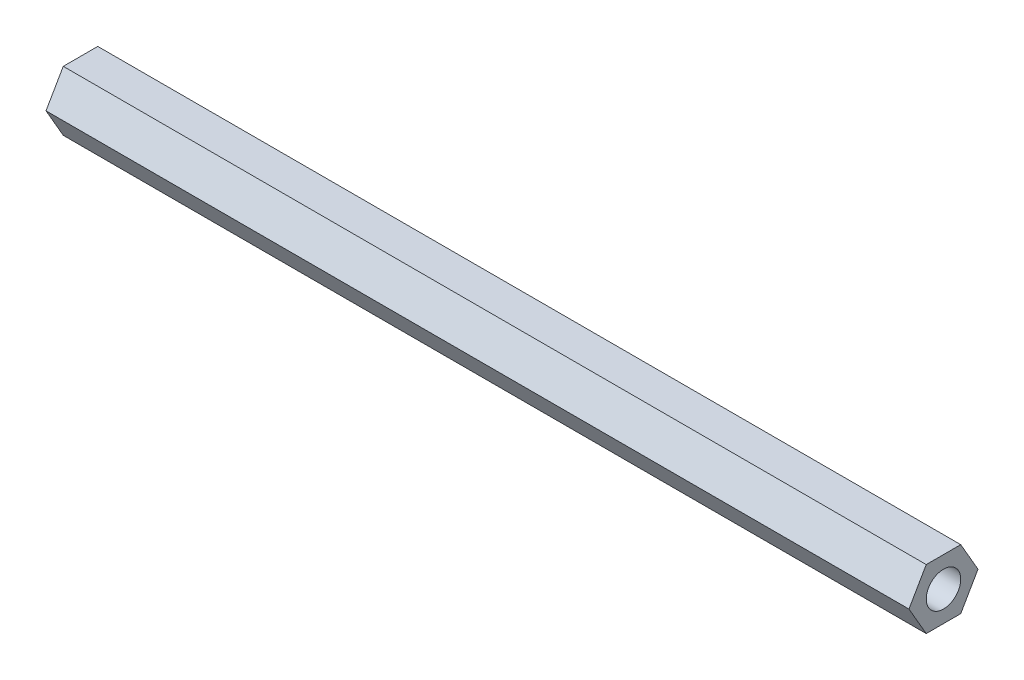
ISO-10303-21;
HEADER;
FILE_DESCRIPTION(('STEP AP214'),'2;1');
FILE_NAME('part.step','',(''),(''),'','','');
FILE_SCHEMA(('AUTOMOTIVE_DESIGN { 1 0 10303 214 1 1 1 1 }'));
ENDSEC;
DATA;
#1=APPLICATION_CONTEXT('core data for automotive mechanical design processes');
#2=APPLICATION_PROTOCOL_DEFINITION('international standard','automotive_design',2000,#1);
#3=PRODUCT_CONTEXT('',#1,'mechanical');
#4=PRODUCT('Part','Part','',(#3));
#5=PRODUCT_RELATED_PRODUCT_CATEGORY('part','',(#4));
#6=PRODUCT_DEFINITION_FORMATION('','',#4);
#7=PRODUCT_DEFINITION_CONTEXT('part definition',#1,'design');
#8=PRODUCT_DEFINITION('design','',#6,#7);
#9=PRODUCT_DEFINITION_SHAPE('','',#8);
#10=(LENGTH_UNIT() NAMED_UNIT(*) SI_UNIT(.MILLI.,.METRE.));
#11=(NAMED_UNIT(*) PLANE_ANGLE_UNIT() SI_UNIT($,.RADIAN.));
#12=(NAMED_UNIT(*) SI_UNIT($,.STERADIAN.) SOLID_ANGLE_UNIT());
#13=UNCERTAINTY_MEASURE_WITH_UNIT(LENGTH_MEASURE(1.E-05),#10,'distance_accuracy_value','');
#14=(GEOMETRIC_REPRESENTATION_CONTEXT(3) GLOBAL_UNCERTAINTY_ASSIGNED_CONTEXT((#13)) GLOBAL_UNIT_ASSIGNED_CONTEXT((#10,
#11,#12)) REPRESENTATION_CONTEXT('',''));
#15=CARTESIAN_POINT('',(0.,0.,0.));
#16=DIRECTION('',(0.,0.,1.));
#17=DIRECTION('',(1.,0.,0.));
#18=AXIS2_PLACEMENT_3D('',#15,#16,#17);
#19=CARTESIAN_POINT('',(50.,0.,0.));
#20=DIRECTION('',(1.,0.,0.));
#21=DIRECTION('',(0.,0.,-1.));
#22=AXIS2_PLACEMENT_3D('',#19,#20,#21);
#23=PLANE('',#22);
#24=DIRECTION('',(0.,0.866025403784438,0.5));
#25=VECTOR('',#24,1.);
#26=CARTESIAN_POINT('',(50.,0.,-2.));
#27=LINE('',#26,#25);
#28=CARTESIAN_POINT('',(50.,0.,-2.));
#29=VERTEX_POINT('',#28);
#30=CARTESIAN_POINT('',(50.,1.73205080756888,-0.999999999999999));
#31=VERTEX_POINT('',#30);
#32=EDGE_CURVE('E152',#29,#31,#27,.T.);
#33=ORIENTED_EDGE('',*,*,#32,.T.);
#34=DIRECTION('',(0.,0.,1.));
#35=VECTOR('',#34,1.);
#36=CARTESIAN_POINT('',(50.,1.73205080756888,-0.999999999999999));
#37=LINE('',#36,#35);
#38=CARTESIAN_POINT('',(50.,1.73205080756888,1.));
#39=VERTEX_POINT('',#38);
#40=EDGE_CURVE('E100',#31,#39,#37,.T.);
#41=ORIENTED_EDGE('',*,*,#40,.T.);
#42=DIRECTION('',(0.,-0.866025403784439,0.5));
#43=VECTOR('',#42,1.);
#44=CARTESIAN_POINT('',(50.,1.73205080756888,1.));
#45=LINE('',#44,#43);
#46=CARTESIAN_POINT('',(50.,0.,2.));
#47=VERTEX_POINT('',#46);
#48=EDGE_CURVE('E113',#39,#47,#45,.T.);
#49=ORIENTED_EDGE('',*,*,#48,.T.);
#50=DIRECTION('',(0.,-0.866025403784439,-0.5));
#51=VECTOR('',#50,1.);
#52=CARTESIAN_POINT('',(50.,0.,2.));
#53=LINE('',#52,#51);
#54=CARTESIAN_POINT('',(50.,-1.73205080756888,0.999999999999999));
#55=VERTEX_POINT('',#54);
#56=EDGE_CURVE('E107',#47,#55,#53,.T.);
#57=ORIENTED_EDGE('',*,*,#56,.T.);
#58=DIRECTION('',(0.,0.,-1.));
#59=VECTOR('',#58,1.);
#60=CARTESIAN_POINT('',(50.,-1.73205080756888,0.999999999999999));
#61=LINE('',#60,#59);
#62=CARTESIAN_POINT('',(50.,-1.73205080756888,-1.));
#63=VERTEX_POINT('',#62);
#64=EDGE_CURVE('E111',#55,#63,#61,.T.);
#65=ORIENTED_EDGE('',*,*,#64,.T.);
#66=DIRECTION('',(0.,0.866025403784439,-0.5));
#67=VECTOR('',#66,1.);
#68=CARTESIAN_POINT('',(50.,-1.73205080756888,-1.));
#69=LINE('',#68,#67);
#70=EDGE_CURVE('E63',#63,#29,#69,.T.);
#71=ORIENTED_EDGE('',*,*,#70,.T.);
#72=EDGE_LOOP('',(#33,#41,#49,#57,#65,#71));
#73=FACE_BOUND('',#72,.T.);
#74=CARTESIAN_POINT('',(50.,0.,0.));
#75=DIRECTION('',(1.,0.,0.));
#76=DIRECTION('',(0.,0.,-1.));
#77=AXIS2_PLACEMENT_3D('',#74,#75,#76);
#78=CIRCLE('',#77,1.);
#79=CARTESIAN_POINT('',(50.,0.,-1.));
#80=VERTEX_POINT('',#79);
#81=EDGE_CURVE('E140',#80,#80,#78,.T.);
#82=ORIENTED_EDGE('',*,*,#81,.F.);
#83=EDGE_LOOP('',(#82));
#84=FACE_BOUND('',#83,.T.);
#85=ADVANCED_FACE('F45',(#73,#84),#23,.T.);
#86=CARTESIAN_POINT('',(0.,0.,0.));
#87=DIRECTION('',(1.,0.,0.));
#88=DIRECTION('',(0.,0.,-1.));
#89=AXIS2_PLACEMENT_3D('',#86,#87,#88);
#90=PLANE('',#89);
#91=DIRECTION('',(0.,0.866025403784438,0.5));
#92=VECTOR('',#91,1.);
#93=CARTESIAN_POINT('',(0.,0.,-2.));
#94=LINE('',#93,#92);
#95=CARTESIAN_POINT('',(0.,0.,-2.));
#96=VERTEX_POINT('',#95);
#97=CARTESIAN_POINT('',(0.,1.73205080756888,-0.999999999999999));
#98=VERTEX_POINT('',#97);
#99=EDGE_CURVE('E135',#96,#98,#94,.T.);
#100=ORIENTED_EDGE('',*,*,#99,.F.);
#101=DIRECTION('',(0.,0.866025403784439,-0.5));
#102=VECTOR('',#101,1.);
#103=CARTESIAN_POINT('',(0.,-1.73205080756888,-1.));
#104=LINE('',#103,#102);
#105=CARTESIAN_POINT('',(0.,-1.73205080756888,-1.));
#106=VERTEX_POINT('',#105);
#107=EDGE_CURVE('E92',#106,#96,#104,.T.);
#108=ORIENTED_EDGE('',*,*,#107,.F.);
#109=DIRECTION('',(0.,0.,-1.));
#110=VECTOR('',#109,1.);
#111=CARTESIAN_POINT('',(0.,-1.73205080756888,0.999999999999999));
#112=LINE('',#111,#110);
#113=CARTESIAN_POINT('',(0.,-1.73205080756888,0.999999999999999));
#114=VERTEX_POINT('',#113);
#115=EDGE_CURVE('E86',#114,#106,#112,.T.);
#116=ORIENTED_EDGE('',*,*,#115,.F.);
#117=DIRECTION('',(0.,-0.866025403784439,-0.5));
#118=VECTOR('',#117,1.);
#119=CARTESIAN_POINT('',(0.,0.,2.));
#120=LINE('',#119,#118);
#121=CARTESIAN_POINT('',(0.,0.,2.));
#122=VERTEX_POINT('',#121);
#123=EDGE_CURVE('E122',#122,#114,#120,.T.);
#124=ORIENTED_EDGE('',*,*,#123,.F.);
#125=DIRECTION('',(0.,-0.866025403784439,0.5));
#126=VECTOR('',#125,1.);
#127=CARTESIAN_POINT('',(0.,1.73205080756888,1.));
#128=LINE('',#127,#126);
#129=CARTESIAN_POINT('',(0.,1.73205080756888,1.));
#130=VERTEX_POINT('',#129);
#131=EDGE_CURVE('E143',#130,#122,#128,.T.);
#132=ORIENTED_EDGE('',*,*,#131,.F.);
#133=DIRECTION('',(0.,0.,1.));
#134=VECTOR('',#133,1.);
#135=CARTESIAN_POINT('',(0.,1.73205080756888,-0.999999999999999));
#136=LINE('',#135,#134);
#137=EDGE_CURVE('E139',#98,#130,#136,.T.);
#138=ORIENTED_EDGE('',*,*,#137,.F.);
#139=EDGE_LOOP('',(#100,#108,#116,#124,#132,#138));
#140=FACE_BOUND('',#139,.T.);
#141=CARTESIAN_POINT('',(0.,0.,0.));
#142=DIRECTION('',(1.,0.,0.));
#143=DIRECTION('',(0.,0.,-1.));
#144=AXIS2_PLACEMENT_3D('',#141,#142,#143);
#145=CIRCLE('',#144,1.);
#146=CARTESIAN_POINT('',(0.,0.,-1.));
#147=VERTEX_POINT('',#146);
#148=EDGE_CURVE('E249',#147,#147,#145,.T.);
#149=ORIENTED_EDGE('',*,*,#148,.T.);
#150=EDGE_LOOP('',(#149));
#151=FACE_BOUND('',#150,.T.);
#152=ADVANCED_FACE('F165',(#140,#151),#90,.F.);
#153=CARTESIAN_POINT('',(50.,0.,-2.));
#154=DIRECTION('',(0.,-0.5,0.866025403784438));
#155=DIRECTION('',(0.,-0.866025403784438,-0.5));
#156=AXIS2_PLACEMENT_3D('',#153,#154,#155);
#157=PLANE('',#156);
#158=ORIENTED_EDGE('',*,*,#99,.T.);
#159=DIRECTION('',(-1.,0.,0.));
#160=VECTOR('',#159,1.);
#161=CARTESIAN_POINT('',(50.,1.73205080756888,-0.999999999999999));
#162=LINE('',#161,#160);
#163=EDGE_CURVE('E11',#31,#98,#162,.T.);
#164=ORIENTED_EDGE('',*,*,#163,.F.);
#165=ORIENTED_EDGE('',*,*,#32,.F.);
#166=DIRECTION('',(-1.,0.,0.));
#167=VECTOR('',#166,1.);
#168=CARTESIAN_POINT('',(50.,0.,-2.));
#169=LINE('',#168,#167);
#170=EDGE_CURVE('E131',#29,#96,#169,.T.);
#171=ORIENTED_EDGE('',*,*,#170,.T.);
#172=EDGE_LOOP('',(#158,#164,#165,#171));
#173=FACE_BOUND('',#172,.T.);
#174=ADVANCED_FACE('F47',(#173),#157,.F.);
#175=CARTESIAN_POINT('',(50.,1.73205080756888,-0.999999999999999));
#176=DIRECTION('',(0.,-1.,0.));
#177=DIRECTION('',(0.,0.,-1.));
#178=AXIS2_PLACEMENT_3D('',#175,#176,#177);
#179=PLANE('',#178);
#180=ORIENTED_EDGE('',*,*,#137,.T.);
#181=DIRECTION('',(-1.,0.,0.));
#182=VECTOR('',#181,1.);
#183=CARTESIAN_POINT('',(50.,1.73205080756888,1.));
#184=LINE('',#183,#182);
#185=EDGE_CURVE('E55',#39,#130,#184,.T.);
#186=ORIENTED_EDGE('',*,*,#185,.F.);
#187=ORIENTED_EDGE('',*,*,#40,.F.);
#188=ORIENTED_EDGE('',*,*,#163,.T.);
#189=EDGE_LOOP('',(#180,#186,#187,#188));
#190=FACE_BOUND('',#189,.T.);
#191=ADVANCED_FACE('F190',(#190),#179,.F.);
#192=CARTESIAN_POINT('',(50.,1.73205080756888,1.));
#193=DIRECTION('',(0.,-0.5,-0.866025403784439));
#194=DIRECTION('',(0.,0.866025403784439,-0.5));
#195=AXIS2_PLACEMENT_3D('',#192,#193,#194);
#196=PLANE('',#195);
#197=ORIENTED_EDGE('',*,*,#131,.T.);
#198=DIRECTION('',(-1.,0.,0.));
#199=VECTOR('',#198,1.);
#200=CARTESIAN_POINT('',(50.,0.,2.));
#201=LINE('',#200,#199);
#202=EDGE_CURVE('E124',#47,#122,#201,.T.);
#203=ORIENTED_EDGE('',*,*,#202,.F.);
#204=ORIENTED_EDGE('',*,*,#48,.F.);
#205=ORIENTED_EDGE('',*,*,#185,.T.);
#206=EDGE_LOOP('',(#197,#203,#204,#205));
#207=FACE_BOUND('',#206,.T.);
#208=ADVANCED_FACE('F162',(#207),#196,.F.);
#209=CARTESIAN_POINT('',(50.,0.,2.));
#210=DIRECTION('',(0.,0.5,-0.866025403784439));
#211=DIRECTION('',(0.,0.866025403784439,0.5));
#212=AXIS2_PLACEMENT_3D('',#209,#210,#211);
#213=PLANE('',#212);
#214=ORIENTED_EDGE('',*,*,#123,.T.);
#215=DIRECTION('',(-1.,0.,0.));
#216=VECTOR('',#215,1.);
#217=CARTESIAN_POINT('',(50.,-1.73205080756888,0.999999999999999));
#218=LINE('',#217,#216);
#219=EDGE_CURVE('E119',#55,#114,#218,.T.);
#220=ORIENTED_EDGE('',*,*,#219,.F.);
#221=ORIENTED_EDGE('',*,*,#56,.F.);
#222=ORIENTED_EDGE('',*,*,#202,.T.);
#223=EDGE_LOOP('',(#214,#220,#221,#222));
#224=FACE_BOUND('',#223,.T.);
#225=ADVANCED_FACE('F120',(#224),#213,.F.);
#226=CARTESIAN_POINT('',(50.,-1.73205080756888,0.999999999999999));
#227=DIRECTION('',(0.,1.,0.));
#228=DIRECTION('',(0.,0.,1.));
#229=AXIS2_PLACEMENT_3D('',#226,#227,#228);
#230=PLANE('',#229);
#231=ORIENTED_EDGE('',*,*,#115,.T.);
#232=DIRECTION('',(-1.,0.,0.));
#233=VECTOR('',#232,1.);
#234=CARTESIAN_POINT('',(50.,-1.73205080756888,-1.));
#235=LINE('',#234,#233);
#236=EDGE_CURVE('E125',#63,#106,#235,.T.);
#237=ORIENTED_EDGE('',*,*,#236,.F.);
#238=ORIENTED_EDGE('',*,*,#64,.F.);
#239=ORIENTED_EDGE('',*,*,#219,.T.);
#240=EDGE_LOOP('',(#231,#237,#238,#239));
#241=FACE_BOUND('',#240,.T.);
#242=ADVANCED_FACE('F127',(#241),#230,.F.);
#243=CARTESIAN_POINT('',(50.,-1.73205080756888,-1.));
#244=DIRECTION('',(0.,0.5,0.866025403784439));
#245=DIRECTION('',(0.,-0.866025403784439,0.5));
#246=AXIS2_PLACEMENT_3D('',#243,#244,#245);
#247=PLANE('',#246);
#248=ORIENTED_EDGE('',*,*,#107,.T.);
#249=ORIENTED_EDGE('',*,*,#170,.F.);
#250=ORIENTED_EDGE('',*,*,#70,.F.);
#251=ORIENTED_EDGE('',*,*,#236,.T.);
#252=EDGE_LOOP('',(#248,#249,#250,#251));
#253=FACE_BOUND('',#252,.T.);
#254=ADVANCED_FACE('F170',(#253),#247,.F.);
#255=CARTESIAN_POINT('',(50.,0.,0.));
#256=DIRECTION('',(-1.,0.,0.));
#257=DIRECTION('',(0.,0.,1.));
#258=AXIS2_PLACEMENT_3D('',#255,#256,#257);
#259=CYLINDRICAL_SURFACE('',#258,1.);
#260=ORIENTED_EDGE('',*,*,#81,.T.);
#261=EDGE_LOOP('',(#260));
#262=FACE_BOUND('',#261,.T.);
#263=ORIENTED_EDGE('',*,*,#148,.F.);
#264=EDGE_LOOP('',(#263));
#265=FACE_BOUND('',#264,.T.);
#266=ADVANCED_FACE('F172',(#262,#265),#259,.F.);
#267=CLOSED_SHELL('',(#85,#152,#174,#191,#208,#225,#242,#254,#266));
#268=MANIFOLD_SOLID_BREP('B2',#267);
#269=ADVANCED_BREP_SHAPE_REPRESENTATION('',(#18,#268),#14);
#270=SHAPE_DEFINITION_REPRESENTATION(#9,#269);
ENDSEC;
END-ISO-10303-21;
